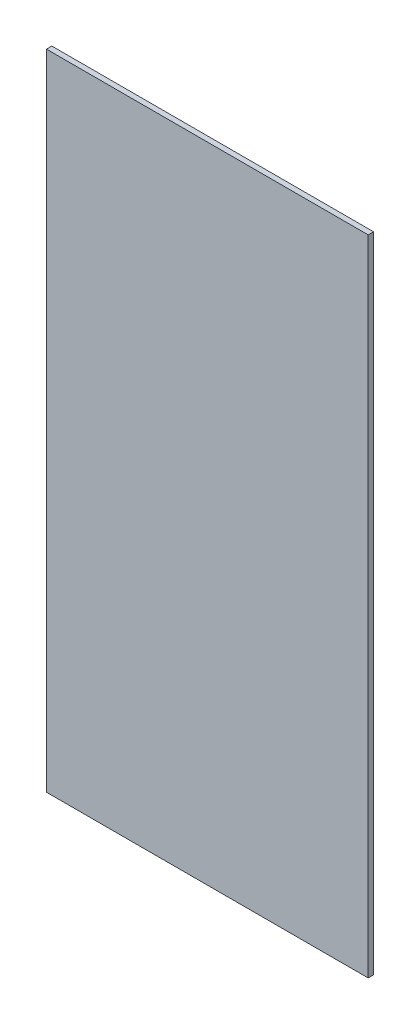
ISO-10303-21;
HEADER;
FILE_DESCRIPTION(('STEP AP214'),'2;1');
FILE_NAME('part.step','',(''),(''),'','','');
FILE_SCHEMA(('AUTOMOTIVE_DESIGN { 1 0 10303 214 1 1 1 1 }'));
ENDSEC;
DATA;
#1=APPLICATION_CONTEXT('core data for automotive mechanical design processes');
#2=APPLICATION_PROTOCOL_DEFINITION('international standard','automotive_design',2000,#1);
#3=PRODUCT_CONTEXT('',#1,'mechanical');
#4=PRODUCT('Part','Part','',(#3));
#5=PRODUCT_RELATED_PRODUCT_CATEGORY('part','',(#4));
#6=PRODUCT_DEFINITION_FORMATION('','',#4);
#7=PRODUCT_DEFINITION_CONTEXT('part definition',#1,'design');
#8=PRODUCT_DEFINITION('design','',#6,#7);
#9=PRODUCT_DEFINITION_SHAPE('','',#8);
#10=(LENGTH_UNIT() NAMED_UNIT(*) SI_UNIT(.MILLI.,.METRE.));
#11=(NAMED_UNIT(*) PLANE_ANGLE_UNIT() SI_UNIT($,.RADIAN.));
#12=(NAMED_UNIT(*) SI_UNIT($,.STERADIAN.) SOLID_ANGLE_UNIT());
#13=UNCERTAINTY_MEASURE_WITH_UNIT(LENGTH_MEASURE(1.E-05),#10,'distance_accuracy_value','');
#14=(GEOMETRIC_REPRESENTATION_CONTEXT(3) GLOBAL_UNCERTAINTY_ASSIGNED_CONTEXT((#13)) GLOBAL_UNIT_ASSIGNED_CONTEXT((#10,
#11,#12)) REPRESENTATION_CONTEXT('',''));
#15=CARTESIAN_POINT('',(0.,0.,0.));
#16=DIRECTION('',(0.,0.,1.));
#17=DIRECTION('',(1.,0.,0.));
#18=AXIS2_PLACEMENT_3D('',#15,#16,#17);
#19=CARTESIAN_POINT('',(-76.2,152.4,1.27));
#20=DIRECTION('',(1.,0.,0.));
#21=DIRECTION('',(0.,0.,-1.));
#22=AXIS2_PLACEMENT_3D('',#19,#20,#21);
#23=PLANE('',#22);
#24=DIRECTION('',(0.,-1.,0.));
#25=VECTOR('',#24,1.);
#26=CARTESIAN_POINT('',(-76.2,152.4,-1.27));
#27=LINE('',#26,#25);
#28=CARTESIAN_POINT('',(-76.2,152.4,-1.27));
#29=VERTEX_POINT('',#28);
#30=CARTESIAN_POINT('',(-76.2,-152.4,-1.27));
#31=VERTEX_POINT('',#30);
#32=EDGE_CURVE('E97',#29,#31,#27,.T.);
#33=ORIENTED_EDGE('',*,*,#32,.T.);
#34=DIRECTION('',(0.,0.,-1.));
#35=VECTOR('',#34,1.);
#36=CARTESIAN_POINT('',(-76.2,-152.4,1.27));
#37=LINE('',#36,#35);
#38=CARTESIAN_POINT('',(-76.2,-152.4,1.27));
#39=VERTEX_POINT('',#38);
#40=EDGE_CURVE('E11',#39,#31,#37,.T.);
#41=ORIENTED_EDGE('',*,*,#40,.F.);
#42=DIRECTION('',(0.,-1.,0.));
#43=VECTOR('',#42,1.);
#44=CARTESIAN_POINT('',(-76.2,152.4,1.27));
#45=LINE('',#44,#43);
#46=CARTESIAN_POINT('',(-76.2,152.4,1.27));
#47=VERTEX_POINT('',#46);
#48=EDGE_CURVE('E85',#47,#39,#45,.T.);
#49=ORIENTED_EDGE('',*,*,#48,.F.);
#50=DIRECTION('',(0.,0.,-1.));
#51=VECTOR('',#50,1.);
#52=CARTESIAN_POINT('',(-76.2,152.4,1.27));
#53=LINE('',#52,#51);
#54=EDGE_CURVE('E93',#47,#29,#53,.T.);
#55=ORIENTED_EDGE('',*,*,#54,.T.);
#56=EDGE_LOOP('',(#33,#41,#49,#55));
#57=FACE_BOUND('',#56,.T.);
#58=ADVANCED_FACE('F34',(#57),#23,.F.);
#59=CARTESIAN_POINT('',(-76.2,-152.4,1.27));
#60=DIRECTION('',(0.,1.,0.));
#61=DIRECTION('',(0.,0.,1.));
#62=AXIS2_PLACEMENT_3D('',#59,#60,#61);
#63=PLANE('',#62);
#64=DIRECTION('',(1.,0.,0.));
#65=VECTOR('',#64,1.);
#66=CARTESIAN_POINT('',(-76.2,-152.4,-1.27));
#67=LINE('',#66,#65);
#68=CARTESIAN_POINT('',(76.2,-152.4,-1.27));
#69=VERTEX_POINT('',#68);
#70=EDGE_CURVE('E89',#31,#69,#67,.T.);
#71=ORIENTED_EDGE('',*,*,#70,.T.);
#72=DIRECTION('',(0.,0.,-1.));
#73=VECTOR('',#72,1.);
#74=CARTESIAN_POINT('',(76.2,-152.4,1.27));
#75=LINE('',#74,#73);
#76=CARTESIAN_POINT('',(76.2,-152.4,1.27));
#77=VERTEX_POINT('',#76);
#78=EDGE_CURVE('E42',#77,#69,#75,.T.);
#79=ORIENTED_EDGE('',*,*,#78,.F.);
#80=DIRECTION('',(1.,0.,0.));
#81=VECTOR('',#80,1.);
#82=CARTESIAN_POINT('',(-76.2,-152.4,1.27));
#83=LINE('',#82,#81);
#84=EDGE_CURVE('E80',#39,#77,#83,.T.);
#85=ORIENTED_EDGE('',*,*,#84,.F.);
#86=ORIENTED_EDGE('',*,*,#40,.T.);
#87=EDGE_LOOP('',(#71,#79,#85,#86));
#88=FACE_BOUND('',#87,.T.);
#89=ADVANCED_FACE('F88',(#88),#63,.F.);
#90=CARTESIAN_POINT('',(76.2,152.4,1.27));
#91=DIRECTION('',(-1.,0.,0.));
#92=DIRECTION('',(0.,0.,1.));
#93=AXIS2_PLACEMENT_3D('',#90,#91,#92);
#94=PLANE('',#93);
#95=DIRECTION('',(0.,1.,0.));
#96=VECTOR('',#95,1.);
#97=CARTESIAN_POINT('',(76.2,152.4,-1.27));
#98=LINE('',#97,#96);
#99=CARTESIAN_POINT('',(76.2,152.4,-1.27));
#100=VERTEX_POINT('',#99);
#101=EDGE_CURVE('E67',#69,#100,#98,.T.);
#102=ORIENTED_EDGE('',*,*,#101,.T.);
#103=DIRECTION('',(0.,0.,-1.));
#104=VECTOR('',#103,1.);
#105=CARTESIAN_POINT('',(76.2,152.4,1.27));
#106=LINE('',#105,#104);
#107=CARTESIAN_POINT('',(76.2,152.4,1.27));
#108=VERTEX_POINT('',#107);
#109=EDGE_CURVE('E90',#108,#100,#106,.T.);
#110=ORIENTED_EDGE('',*,*,#109,.F.);
#111=DIRECTION('',(0.,1.,0.));
#112=VECTOR('',#111,1.);
#113=CARTESIAN_POINT('',(76.2,152.4,1.27));
#114=LINE('',#113,#112);
#115=EDGE_CURVE('E83',#77,#108,#114,.T.);
#116=ORIENTED_EDGE('',*,*,#115,.F.);
#117=ORIENTED_EDGE('',*,*,#78,.T.);
#118=EDGE_LOOP('',(#102,#110,#116,#117));
#119=FACE_BOUND('',#118,.T.);
#120=ADVANCED_FACE('F91',(#119),#94,.F.);
#121=CARTESIAN_POINT('',(-76.2,152.4,1.27));
#122=DIRECTION('',(0.,-1.,0.));
#123=DIRECTION('',(0.,0.,-1.));
#124=AXIS2_PLACEMENT_3D('',#121,#122,#123);
#125=PLANE('',#124);
#126=DIRECTION('',(-1.,0.,0.));
#127=VECTOR('',#126,1.);
#128=CARTESIAN_POINT('',(-76.2,152.4,-1.27));
#129=LINE('',#128,#127);
#130=EDGE_CURVE('E73',#100,#29,#129,.T.);
#131=ORIENTED_EDGE('',*,*,#130,.T.);
#132=ORIENTED_EDGE('',*,*,#54,.F.);
#133=DIRECTION('',(-1.,0.,0.));
#134=VECTOR('',#133,1.);
#135=CARTESIAN_POINT('',(-76.2,152.4,1.27));
#136=LINE('',#135,#134);
#137=EDGE_CURVE('E50',#108,#47,#136,.T.);
#138=ORIENTED_EDGE('',*,*,#137,.F.);
#139=ORIENTED_EDGE('',*,*,#109,.T.);
#140=EDGE_LOOP('',(#131,#132,#138,#139));
#141=FACE_BOUND('',#140,.T.);
#142=ADVANCED_FACE('F104',(#141),#125,.F.);
#143=CARTESIAN_POINT('',(0.,0.,1.27));
#144=DIRECTION('',(0.,0.,1.));
#145=DIRECTION('',(1.,0.,0.));
#146=AXIS2_PLACEMENT_3D('',#143,#144,#145);
#147=PLANE('',#146);
#148=ORIENTED_EDGE('',*,*,#48,.T.);
#149=ORIENTED_EDGE('',*,*,#84,.T.);
#150=ORIENTED_EDGE('',*,*,#115,.T.);
#151=ORIENTED_EDGE('',*,*,#137,.T.);
#152=EDGE_LOOP('',(#148,#149,#150,#151));
#153=FACE_BOUND('',#152,.T.);
#154=ADVANCED_FACE('F81',(#153),#147,.T.);
#155=CARTESIAN_POINT('',(0.,0.,-1.27));
#156=DIRECTION('',(0.,0.,1.));
#157=DIRECTION('',(1.,0.,0.));
#158=AXIS2_PLACEMENT_3D('',#155,#156,#157);
#159=PLANE('',#158);
#160=ORIENTED_EDGE('',*,*,#32,.F.);
#161=ORIENTED_EDGE('',*,*,#130,.F.);
#162=ORIENTED_EDGE('',*,*,#101,.F.);
#163=ORIENTED_EDGE('',*,*,#70,.F.);
#164=EDGE_LOOP('',(#160,#161,#162,#163));
#165=FACE_BOUND('',#164,.T.);
#166=ADVANCED_FACE('F107',(#165),#159,.F.);
#167=CLOSED_SHELL('',(#58,#89,#120,#142,#154,#166));
#168=MANIFOLD_SOLID_BREP('B2',#167);
#169=ADVANCED_BREP_SHAPE_REPRESENTATION('',(#18,#168),#14);
#170=SHAPE_DEFINITION_REPRESENTATION(#9,#169);
ENDSEC;
END-ISO-10303-21;
